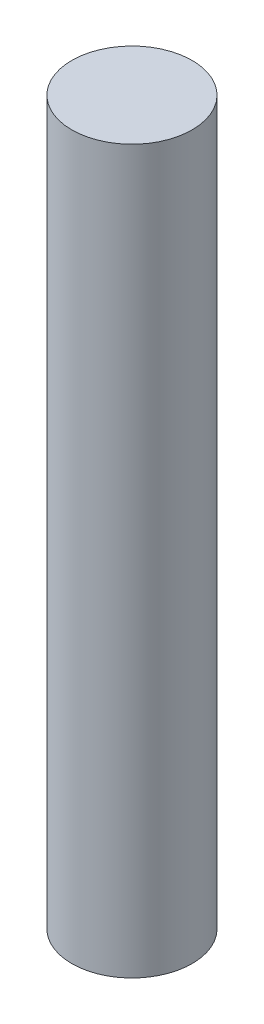
ISO-10303-21;
HEADER;
FILE_DESCRIPTION(('STEP AP214'),'2;1');
FILE_NAME('part.step','',(''),(''),'','','');
FILE_SCHEMA(('AUTOMOTIVE_DESIGN { 1 0 10303 214 1 1 1 1 }'));
ENDSEC;
DATA;
#1=APPLICATION_CONTEXT('core data for automotive mechanical design processes');
#2=APPLICATION_PROTOCOL_DEFINITION('international standard','automotive_design',2000,#1);
#3=PRODUCT_CONTEXT('',#1,'mechanical');
#4=PRODUCT('Part','Part','',(#3));
#5=PRODUCT_RELATED_PRODUCT_CATEGORY('part','',(#4));
#6=PRODUCT_DEFINITION_FORMATION('','',#4);
#7=PRODUCT_DEFINITION_CONTEXT('part definition',#1,'design');
#8=PRODUCT_DEFINITION('design','',#6,#7);
#9=PRODUCT_DEFINITION_SHAPE('','',#8);
#10=(LENGTH_UNIT() NAMED_UNIT(*) SI_UNIT(.MILLI.,.METRE.));
#11=(NAMED_UNIT(*) PLANE_ANGLE_UNIT() SI_UNIT($,.RADIAN.));
#12=(NAMED_UNIT(*) SI_UNIT($,.STERADIAN.) SOLID_ANGLE_UNIT());
#13=UNCERTAINTY_MEASURE_WITH_UNIT(LENGTH_MEASURE(1.E-05),#10,'distance_accuracy_value','');
#14=(GEOMETRIC_REPRESENTATION_CONTEXT(3) GLOBAL_UNCERTAINTY_ASSIGNED_CONTEXT((#13)) GLOBAL_UNIT_ASSIGNED_CONTEXT((#10,
#11,#12)) REPRESENTATION_CONTEXT('',''));
#15=CARTESIAN_POINT('',(0.,0.,0.));
#16=DIRECTION('',(0.,0.,1.));
#17=DIRECTION('',(1.,0.,0.));
#18=AXIS2_PLACEMENT_3D('',#15,#16,#17);
#19=CARTESIAN_POINT('',(0.,30.,0.));
#20=DIRECTION('',(0.,-1.,0.));
#21=DIRECTION('',(0.,0.,-1.));
#22=AXIS2_PLACEMENT_3D('',#19,#20,#21);
#23=CYLINDRICAL_SURFACE('',#22,2.5);
#24=CARTESIAN_POINT('',(0.,30.,0.));
#25=DIRECTION('',(0.,1.,0.));
#26=DIRECTION('',(0.,0.,1.));
#27=AXIS2_PLACEMENT_3D('',#24,#25,#26);
#28=CIRCLE('',#27,2.5);
#29=CARTESIAN_POINT('',(0.,30.,2.5));
#30=VERTEX_POINT('',#29);
#31=EDGE_CURVE('E10',#30,#30,#28,.T.);
#32=ORIENTED_EDGE('',*,*,#31,.F.);
#33=EDGE_LOOP('',(#32));
#34=FACE_BOUND('',#33,.T.);
#35=CARTESIAN_POINT('',(0.,0.,0.));
#36=DIRECTION('',(0.,1.,0.));
#37=DIRECTION('',(0.,0.,1.));
#38=AXIS2_PLACEMENT_3D('',#35,#36,#37);
#39=CIRCLE('',#38,2.5);
#40=CARTESIAN_POINT('',(0.,0.,2.5));
#41=VERTEX_POINT('',#40);
#42=EDGE_CURVE('E38',#41,#41,#39,.T.);
#43=ORIENTED_EDGE('',*,*,#42,.T.);
#44=EDGE_LOOP('',(#43));
#45=FACE_BOUND('',#44,.T.);
#46=ADVANCED_FACE('F35',(#34,#45),#23,.T.);
#47=CARTESIAN_POINT('',(0.,30.,0.));
#48=DIRECTION('',(0.,1.,0.));
#49=DIRECTION('',(0.,0.,1.));
#50=AXIS2_PLACEMENT_3D('',#47,#48,#49);
#51=PLANE('',#50);
#52=ORIENTED_EDGE('',*,*,#31,.T.);
#53=EDGE_LOOP('',(#52));
#54=FACE_BOUND('',#53,.T.);
#55=ADVANCED_FACE('F50',(#54),#51,.T.);
#56=CARTESIAN_POINT('',(0.,0.,0.));
#57=DIRECTION('',(0.,1.,0.));
#58=DIRECTION('',(0.,0.,1.));
#59=AXIS2_PLACEMENT_3D('',#56,#57,#58);
#60=PLANE('',#59);
#61=ORIENTED_EDGE('',*,*,#42,.F.);
#62=EDGE_LOOP('',(#61));
#63=FACE_BOUND('',#62,.T.);
#64=ADVANCED_FACE('F48',(#63),#60,.F.);
#65=CLOSED_SHELL('',(#46,#55,#64));
#66=MANIFOLD_SOLID_BREP('B2',#65);
#67=ADVANCED_BREP_SHAPE_REPRESENTATION('',(#18,#66),#14);
#68=SHAPE_DEFINITION_REPRESENTATION(#9,#67);
ENDSEC;
END-ISO-10303-21;
